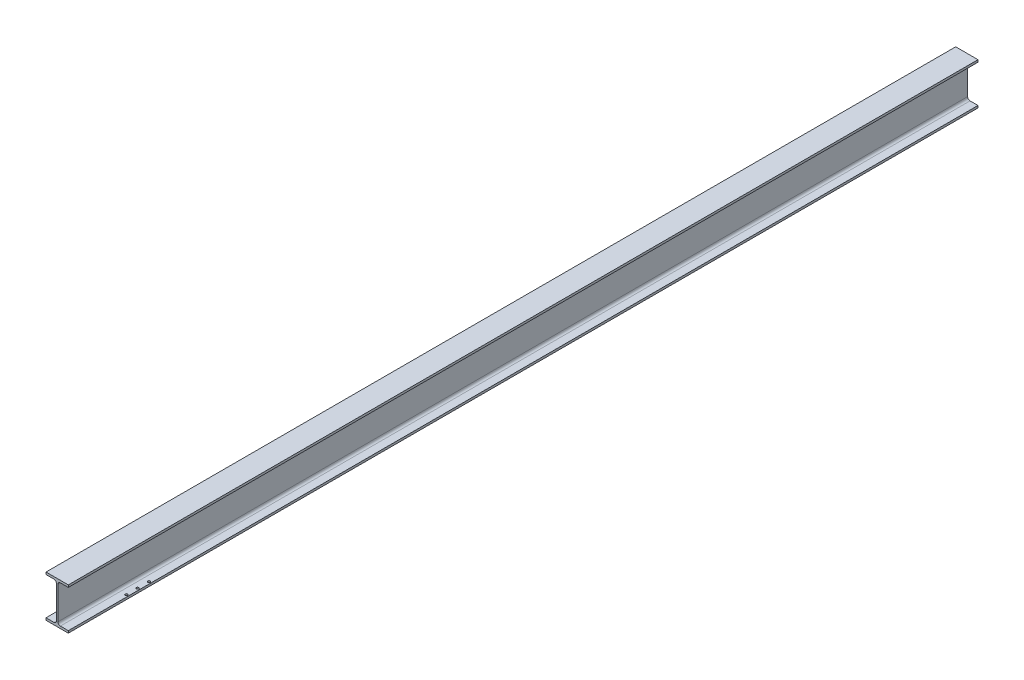
ISO-10303-21;
HEADER;
FILE_DESCRIPTION(('STEP AP214'),'2;1');
FILE_NAME('part.step','',(''),(''),'','','');
FILE_SCHEMA(('AUTOMOTIVE_DESIGN { 1 0 10303 214 1 1 1 1 }'));
ENDSEC;
DATA;
#1=APPLICATION_CONTEXT('core data for automotive mechanical design processes');
#2=APPLICATION_PROTOCOL_DEFINITION('international standard','automotive_design',2000,#1);
#3=PRODUCT_CONTEXT('',#1,'mechanical');
#4=PRODUCT('Part','Part','',(#3));
#5=PRODUCT_RELATED_PRODUCT_CATEGORY('part','',(#4));
#6=PRODUCT_DEFINITION_FORMATION('','',#4);
#7=PRODUCT_DEFINITION_CONTEXT('part definition',#1,'design');
#8=PRODUCT_DEFINITION('design','',#6,#7);
#9=PRODUCT_DEFINITION_SHAPE('','',#8);
#10=(LENGTH_UNIT() NAMED_UNIT(*) SI_UNIT(.MILLI.,.METRE.));
#11=(NAMED_UNIT(*) PLANE_ANGLE_UNIT() SI_UNIT($,.RADIAN.));
#12=(NAMED_UNIT(*) SI_UNIT($,.STERADIAN.) SOLID_ANGLE_UNIT());
#13=UNCERTAINTY_MEASURE_WITH_UNIT(LENGTH_MEASURE(1.E-05),#10,'distance_accuracy_value','');
#14=(GEOMETRIC_REPRESENTATION_CONTEXT(3) GLOBAL_UNCERTAINTY_ASSIGNED_CONTEXT((#13)) GLOBAL_UNIT_ASSIGNED_CONTEXT((#10,
#11,#12)) REPRESENTATION_CONTEXT('',''));
#15=CARTESIAN_POINT('',(0.,0.,0.));
#16=DIRECTION('',(0.,0.,1.));
#17=DIRECTION('',(1.,0.,0.));
#18=AXIS2_PLACEMENT_3D('',#15,#16,#17);
#19=CARTESIAN_POINT('',(0.,-60.,1305.));
#20=DIRECTION('',(0.,1.,0.));
#21=DIRECTION('',(-1.,0.,0.));
#22=AXIS2_PLACEMENT_3D('',#19,#20,#21);
#23=PLANE('',#22);
#24=CARTESIAN_POINT('',(26.,-60.,1067.5));
#25=DIRECTION('',(0.,-1.,0.));
#26=DIRECTION('',(0.,0.,-1.));
#27=AXIS2_PLACEMENT_3D('',#24,#25,#26);
#28=CIRCLE('',#27,3.49999999999999);
#29=CARTESIAN_POINT('',(26.,-60.,1064.));
#30=VERTEX_POINT('',#29);
#31=EDGE_CURVE('E564',#30,#30,#28,.T.);
#32=ORIENTED_EDGE('',*,*,#31,.F.);
#33=EDGE_LOOP('',(#32));
#34=FACE_BOUND('',#33,.T.);
#35=CARTESIAN_POINT('',(-26.,-60.,1100.));
#36=DIRECTION('',(0.,-1.,0.));
#37=DIRECTION('',(0.,0.,-1.));
#38=AXIS2_PLACEMENT_3D('',#35,#36,#37);
#39=CIRCLE('',#38,3.49999999999999);
#40=CARTESIAN_POINT('',(-26.,-60.,1096.5));
#41=VERTEX_POINT('',#40);
#42=EDGE_CURVE('E572',#41,#41,#39,.T.);
#43=ORIENTED_EDGE('',*,*,#42,.F.);
#44=EDGE_LOOP('',(#43));
#45=FACE_BOUND('',#44,.T.);
#46=CARTESIAN_POINT('',(26.,-60.,1100.));
#47=DIRECTION('',(0.,-1.,0.));
#48=DIRECTION('',(0.,0.,-1.));
#49=AXIS2_PLACEMENT_3D('',#46,#47,#48);
#50=CIRCLE('',#49,3.49999999999999);
#51=CARTESIAN_POINT('',(26.,-60.,1096.5));
#52=VERTEX_POINT('',#51);
#53=EDGE_CURVE('E578',#52,#52,#50,.T.);
#54=ORIENTED_EDGE('',*,*,#53,.F.);
#55=EDGE_LOOP('',(#54));
#56=FACE_BOUND('',#55,.T.);
#57=CARTESIAN_POINT('',(26.,-60.,1132.5));
#58=DIRECTION('',(0.,-1.,0.));
#59=DIRECTION('',(0.,0.,-1.));
#60=AXIS2_PLACEMENT_3D('',#57,#58,#59);
#61=CIRCLE('',#60,3.49999999999999);
#62=CARTESIAN_POINT('',(26.,-60.,1129.));
#63=VERTEX_POINT('',#62);
#64=EDGE_CURVE('E589',#63,#63,#61,.T.);
#65=ORIENTED_EDGE('',*,*,#64,.F.);
#66=EDGE_LOOP('',(#65));
#67=FACE_BOUND('',#66,.T.);
#68=DIRECTION('',(1.,0.,0.));
#69=VECTOR('',#68,1.);
#70=CARTESIAN_POINT('',(0.,-60.,-1305.));
#71=LINE('',#70,#69);
#72=CARTESIAN_POINT('',(-32.,-60.,-1305.));
#73=VERTEX_POINT('',#72);
#74=CARTESIAN_POINT('',(32.,-60.,-1305.));
#75=VERTEX_POINT('',#74);
#76=EDGE_CURVE('E166',#73,#75,#71,.T.);
#77=ORIENTED_EDGE('',*,*,#76,.T.);
#78=DIRECTION('',(0.,0.,-1.));
#79=VECTOR('',#78,1.);
#80=CARTESIAN_POINT('',(32.,-60.,1305.));
#81=LINE('',#80,#79);
#82=CARTESIAN_POINT('',(32.,-60.,1305.));
#83=VERTEX_POINT('',#82);
#84=EDGE_CURVE('E163',#83,#75,#81,.T.);
#85=ORIENTED_EDGE('',*,*,#84,.F.);
#86=DIRECTION('',(1.,0.,0.));
#87=VECTOR('',#86,1.);
#88=CARTESIAN_POINT('',(0.,-60.,1305.));
#89=LINE('',#88,#87);
#90=CARTESIAN_POINT('',(-32.,-60.,1305.));
#91=VERTEX_POINT('',#90);
#92=EDGE_CURVE('E148',#91,#83,#89,.T.);
#93=ORIENTED_EDGE('',*,*,#92,.F.);
#94=DIRECTION('',(0.,0.,-1.));
#95=VECTOR('',#94,1.);
#96=CARTESIAN_POINT('',(-32.,-60.,1305.));
#97=LINE('',#96,#95);
#98=EDGE_CURVE('E160',#91,#73,#97,.T.);
#99=ORIENTED_EDGE('',*,*,#98,.T.);
#100=EDGE_LOOP('',(#77,#85,#93,#99));
#101=FACE_BOUND('',#100,.T.);
#102=CARTESIAN_POINT('',(-26.,-60.,1132.5));
#103=DIRECTION('',(0.,-1.,0.));
#104=DIRECTION('',(0.,0.,-1.));
#105=AXIS2_PLACEMENT_3D('',#102,#103,#104);
#106=CIRCLE('',#105,3.49999999999999);
#107=CARTESIAN_POINT('',(-26.,-60.,1129.));
#108=VERTEX_POINT('',#107);
#109=EDGE_CURVE('E584',#108,#108,#106,.T.);
#110=ORIENTED_EDGE('',*,*,#109,.F.);
#111=EDGE_LOOP('',(#110));
#112=FACE_BOUND('',#111,.T.);
#113=CARTESIAN_POINT('',(-26.,-60.,1067.5));
#114=DIRECTION('',(0.,-1.,0.));
#115=DIRECTION('',(0.,0.,-1.));
#116=AXIS2_PLACEMENT_3D('',#113,#114,#115);
#117=CIRCLE('',#116,3.49999999999999);
#118=CARTESIAN_POINT('',(-26.,-60.,1064.));
#119=VERTEX_POINT('',#118);
#120=EDGE_CURVE('E561',#119,#119,#117,.T.);
#121=ORIENTED_EDGE('',*,*,#120,.F.);
#122=EDGE_LOOP('',(#121));
#123=FACE_BOUND('',#122,.T.);
#124=ADVANCED_FACE('F37',(#34,#45,#56,#67,#101,#112,#123),#23,.F.);
#125=CARTESIAN_POINT('',(-32.,60.,1305.));
#126=DIRECTION('',(0.,-1.,0.));
#127=DIRECTION('',(1.,0.,0.));
#128=AXIS2_PLACEMENT_3D('',#125,#126,#127);
#129=PLANE('',#128);
#130=DIRECTION('',(-1.,0.,0.));
#131=VECTOR('',#130,1.);
#132=CARTESIAN_POINT('',(-32.,60.,-1305.));
#133=LINE('',#132,#131);
#134=CARTESIAN_POINT('',(32.,60.,-1305.));
#135=VERTEX_POINT('',#134);
#136=CARTESIAN_POINT('',(-32.,60.,-1305.));
#137=VERTEX_POINT('',#136);
#138=EDGE_CURVE('E170',#135,#137,#133,.T.);
#139=ORIENTED_EDGE('',*,*,#138,.T.);
#140=DIRECTION('',(0.,0.,-1.));
#141=VECTOR('',#140,1.);
#142=CARTESIAN_POINT('',(-32.,60.,1305.));
#143=LINE('',#142,#141);
#144=CARTESIAN_POINT('',(-32.,60.,1305.));
#145=VERTEX_POINT('',#144);
#146=EDGE_CURVE('E245',#145,#137,#143,.T.);
#147=ORIENTED_EDGE('',*,*,#146,.F.);
#148=DIRECTION('',(-1.,0.,0.));
#149=VECTOR('',#148,1.);
#150=CARTESIAN_POINT('',(-32.,60.,1305.));
#151=LINE('',#150,#149);
#152=CARTESIAN_POINT('',(32.,60.,1305.));
#153=VERTEX_POINT('',#152);
#154=EDGE_CURVE('E211',#153,#145,#151,.T.);
#155=ORIENTED_EDGE('',*,*,#154,.F.);
#156=DIRECTION('',(0.,0.,-1.));
#157=VECTOR('',#156,1.);
#158=CARTESIAN_POINT('',(32.,60.,1305.));
#159=LINE('',#158,#157);
#160=EDGE_CURVE('E196',#153,#135,#159,.T.);
#161=ORIENTED_EDGE('',*,*,#160,.T.);
#162=EDGE_LOOP('',(#139,#147,#155,#161));
#163=FACE_BOUND('',#162,.T.);
#164=ADVANCED_FACE('F319',(#163),#129,.F.);
#165=CARTESIAN_POINT('',(-32.,53.7,1305.));
#166=DIRECTION('',(1.,0.,0.));
#167=DIRECTION('',(0.,0.,-1.));
#168=AXIS2_PLACEMENT_3D('',#165,#166,#167);
#169=PLANE('',#168);
#170=DIRECTION('',(0.,-1.,0.));
#171=VECTOR('',#170,1.);
#172=CARTESIAN_POINT('',(-32.,53.7,-1305.));
#173=LINE('',#172,#171);
#174=CARTESIAN_POINT('',(-32.,53.7,-1305.));
#175=VERTEX_POINT('',#174);
#176=EDGE_CURVE('E225',#137,#175,#173,.T.);
#177=ORIENTED_EDGE('',*,*,#176,.T.);
#178=DIRECTION('',(0.,0.,-1.));
#179=VECTOR('',#178,1.);
#180=CARTESIAN_POINT('',(-32.,53.7,1305.));
#181=LINE('',#180,#179);
#182=CARTESIAN_POINT('',(-32.,53.7,1305.));
#183=VERTEX_POINT('',#182);
#184=EDGE_CURVE('E242',#183,#175,#181,.T.);
#185=ORIENTED_EDGE('',*,*,#184,.F.);
#186=DIRECTION('',(0.,-1.,0.));
#187=VECTOR('',#186,1.);
#188=CARTESIAN_POINT('',(-32.,53.7,1305.));
#189=LINE('',#188,#187);
#190=EDGE_CURVE('E213',#145,#183,#189,.T.);
#191=ORIENTED_EDGE('',*,*,#190,.F.);
#192=ORIENTED_EDGE('',*,*,#146,.T.);
#193=EDGE_LOOP('',(#177,#185,#191,#192));
#194=FACE_BOUND('',#193,.T.);
#195=ADVANCED_FACE('F325',(#194),#169,.F.);
#196=CARTESIAN_POINT('',(-2.19999999999999,53.7,1305.));
#197=DIRECTION('',(0.,1.,0.));
#198=DIRECTION('',(0.,0.,1.));
#199=AXIS2_PLACEMENT_3D('',#196,#197,#198);
#200=PLANE('',#199);
#201=DIRECTION('',(1.,0.,0.));
#202=VECTOR('',#201,1.);
#203=CARTESIAN_POINT('',(-2.19999999999999,53.7,-1305.));
#204=LINE('',#203,#202);
#205=CARTESIAN_POINT('',(-9.19999999999999,53.7,-1305.));
#206=VERTEX_POINT('',#205);
#207=EDGE_CURVE('E227',#175,#206,#204,.T.);
#208=ORIENTED_EDGE('',*,*,#207,.T.);
#209=DIRECTION('',(0.,0.,-1.));
#210=VECTOR('',#209,1.);
#211=CARTESIAN_POINT('',(-9.19999999999999,53.7,1305.));
#212=LINE('',#211,#210);
#213=CARTESIAN_POINT('',(-9.19999999999999,53.7,1305.));
#214=VERTEX_POINT('',#213);
#215=EDGE_CURVE('E263',#206,#214,#212,.F.);
#216=ORIENTED_EDGE('',*,*,#215,.T.);
#217=DIRECTION('',(1.,0.,0.));
#218=VECTOR('',#217,1.);
#219=CARTESIAN_POINT('',(-2.19999999999999,53.7,1305.));
#220=LINE('',#219,#218);
#221=EDGE_CURVE('E215',#183,#214,#220,.T.);
#222=ORIENTED_EDGE('',*,*,#221,.F.);
#223=ORIENTED_EDGE('',*,*,#184,.T.);
#224=EDGE_LOOP('',(#208,#216,#222,#223));
#225=FACE_BOUND('',#224,.T.);
#226=ADVANCED_FACE('F328',(#225),#200,.F.);
#227=CARTESIAN_POINT('',(-2.19999999999999,-53.7,1305.));
#228=DIRECTION('',(1.,0.,0.));
#229=DIRECTION('',(0.,1.,0.));
#230=AXIS2_PLACEMENT_3D('',#227,#228,#229);
#231=PLANE('',#230);
#232=DIRECTION('',(0.,-1.,0.));
#233=VECTOR('',#232,1.);
#234=CARTESIAN_POINT('',(-2.19999999999999,-53.7,1305.));
#235=LINE('',#234,#233);
#236=CARTESIAN_POINT('',(-2.19999999999999,46.7,1305.));
#237=VERTEX_POINT('',#236);
#238=CARTESIAN_POINT('',(-2.19999999999999,-46.7,1305.));
#239=VERTEX_POINT('',#238);
#240=EDGE_CURVE('E218',#237,#239,#235,.T.);
#241=ORIENTED_EDGE('',*,*,#240,.F.);
#242=DIRECTION('',(0.,0.,-1.));
#243=VECTOR('',#242,1.);
#244=CARTESIAN_POINT('',(-2.19999999999999,46.7,-1305.));
#245=LINE('',#244,#243);
#246=CARTESIAN_POINT('',(-2.19999999999999,46.7,-1305.));
#247=VERTEX_POINT('',#246);
#248=EDGE_CURVE('E260',#237,#247,#245,.T.);
#249=ORIENTED_EDGE('',*,*,#248,.T.);
#250=DIRECTION('',(0.,-1.,0.));
#251=VECTOR('',#250,1.);
#252=CARTESIAN_POINT('',(-2.19999999999999,-53.7,-1305.));
#253=LINE('',#252,#251);
#254=CARTESIAN_POINT('',(-2.19999999999999,-46.7,-1305.));
#255=VERTEX_POINT('',#254);
#256=EDGE_CURVE('E230',#247,#255,#253,.T.);
#257=ORIENTED_EDGE('',*,*,#256,.T.);
#258=DIRECTION('',(0.,0.,-1.));
#259=VECTOR('',#258,1.);
#260=CARTESIAN_POINT('',(-2.19999999999999,-46.7,1305.));
#261=LINE('',#260,#259);
#262=EDGE_CURVE('E258',#255,#239,#261,.F.);
#263=ORIENTED_EDGE('',*,*,#262,.T.);
#264=EDGE_LOOP('',(#241,#249,#257,#263));
#265=FACE_BOUND('',#264,.T.);
#266=ADVANCED_FACE('F285',(#265),#231,.F.);
#267=CARTESIAN_POINT('',(-32.,-53.7,1305.));
#268=DIRECTION('',(0.,-1.,0.));
#269=DIRECTION('',(0.,0.,-1.));
#270=AXIS2_PLACEMENT_3D('',#267,#268,#269);
#271=PLANE('',#270);
#272=CARTESIAN_POINT('',(-26.,-53.7,1067.5));
#273=DIRECTION('',(0.,-1.,0.));
#274=DIRECTION('',(0.,0.,-1.));
#275=AXIS2_PLACEMENT_3D('',#272,#273,#274);
#276=CIRCLE('',#275,3.49999999999999);
#277=CARTESIAN_POINT('',(-26.,-53.7,1064.));
#278=VERTEX_POINT('',#277);
#279=EDGE_CURVE('E558',#278,#278,#276,.T.);
#280=ORIENTED_EDGE('',*,*,#279,.T.);
#281=EDGE_LOOP('',(#280));
#282=FACE_BOUND('',#281,.T.);
#283=CARTESIAN_POINT('',(-26.,-53.7,1100.));
#284=DIRECTION('',(0.,-1.,0.));
#285=DIRECTION('',(0.,0.,-1.));
#286=AXIS2_PLACEMENT_3D('',#283,#284,#285);
#287=CIRCLE('',#286,3.49999999999999);
#288=CARTESIAN_POINT('',(-26.,-53.7,1096.5));
#289=VERTEX_POINT('',#288);
#290=EDGE_CURVE('E575',#289,#289,#287,.T.);
#291=ORIENTED_EDGE('',*,*,#290,.T.);
#292=EDGE_LOOP('',(#291));
#293=FACE_BOUND('',#292,.T.);
#294=CARTESIAN_POINT('',(-26.,-53.7,1132.5));
#295=DIRECTION('',(0.,-1.,0.));
#296=DIRECTION('',(0.,0.,-1.));
#297=AXIS2_PLACEMENT_3D('',#294,#295,#296);
#298=CIRCLE('',#297,3.49999999999999);
#299=CARTESIAN_POINT('',(-26.,-53.7,1129.));
#300=VERTEX_POINT('',#299);
#301=EDGE_CURVE('E587',#300,#300,#298,.T.);
#302=ORIENTED_EDGE('',*,*,#301,.T.);
#303=EDGE_LOOP('',(#302));
#304=FACE_BOUND('',#303,.T.);
#305=DIRECTION('',(-1.,0.,0.));
#306=VECTOR('',#305,1.);
#307=CARTESIAN_POINT('',(-32.,-53.7,1305.));
#308=LINE('',#307,#306);
#309=CARTESIAN_POINT('',(-9.19999999999999,-53.7,1305.));
#310=VERTEX_POINT('',#309);
#311=CARTESIAN_POINT('',(-32.,-53.7,1305.));
#312=VERTEX_POINT('',#311);
#313=EDGE_CURVE('E220',#310,#312,#308,.T.);
#314=ORIENTED_EDGE('',*,*,#313,.F.);
#315=DIRECTION('',(0.,0.,-1.));
#316=VECTOR('',#315,1.);
#317=CARTESIAN_POINT('',(-9.19999999999999,-53.7,-1305.));
#318=LINE('',#317,#316);
#319=CARTESIAN_POINT('',(-9.19999999999999,-53.7,-1305.));
#320=VERTEX_POINT('',#319);
#321=EDGE_CURVE('E265',#310,#320,#318,.T.);
#322=ORIENTED_EDGE('',*,*,#321,.T.);
#323=DIRECTION('',(-1.,0.,0.));
#324=VECTOR('',#323,1.);
#325=CARTESIAN_POINT('',(-32.,-53.7,-1305.));
#326=LINE('',#325,#324);
#327=CARTESIAN_POINT('',(-32.,-53.7,-1305.));
#328=VERTEX_POINT('',#327);
#329=EDGE_CURVE('E233',#320,#328,#326,.T.);
#330=ORIENTED_EDGE('',*,*,#329,.T.);
#331=DIRECTION('',(0.,0.,-1.));
#332=VECTOR('',#331,1.);
#333=CARTESIAN_POINT('',(-32.,-53.7,1305.));
#334=LINE('',#333,#332);
#335=EDGE_CURVE('E239',#312,#328,#334,.T.);
#336=ORIENTED_EDGE('',*,*,#335,.F.);
#337=EDGE_LOOP('',(#314,#322,#330,#336));
#338=FACE_BOUND('',#337,.T.);
#339=ADVANCED_FACE('F288',(#282,#293,#304,#338),#271,.F.);
#340=CARTESIAN_POINT('',(-32.,-60.,1305.));
#341=DIRECTION('',(1.,0.,0.));
#342=DIRECTION('',(0.,0.,-1.));
#343=AXIS2_PLACEMENT_3D('',#340,#341,#342);
#344=PLANE('',#343);
#345=DIRECTION('',(0.,-1.,0.));
#346=VECTOR('',#345,1.);
#347=CARTESIAN_POINT('',(-32.,-60.,-1305.));
#348=LINE('',#347,#346);
#349=EDGE_CURVE('E235',#328,#73,#348,.T.);
#350=ORIENTED_EDGE('',*,*,#349,.T.);
#351=ORIENTED_EDGE('',*,*,#98,.F.);
#352=DIRECTION('',(0.,-1.,0.));
#353=VECTOR('',#352,1.);
#354=CARTESIAN_POINT('',(-32.,-60.,1305.));
#355=LINE('',#354,#353);
#356=EDGE_CURVE('E156',#312,#91,#355,.T.);
#357=ORIENTED_EDGE('',*,*,#356,.F.);
#358=ORIENTED_EDGE('',*,*,#335,.T.);
#359=EDGE_LOOP('',(#350,#351,#357,#358));
#360=FACE_BOUND('',#359,.T.);
#361=ADVANCED_FACE('F291',(#360),#344,.F.);
#362=CARTESIAN_POINT('',(0.,0.,1305.));
#363=DIRECTION('',(0.,0.,-1.));
#364=DIRECTION('',(-1.,0.,0.));
#365=AXIS2_PLACEMENT_3D('',#362,#363,#364);
#366=PLANE('',#365);
#367=ORIENTED_EDGE('',*,*,#154,.T.);
#368=ORIENTED_EDGE('',*,*,#190,.T.);
#369=ORIENTED_EDGE('',*,*,#221,.T.);
#370=CARTESIAN_POINT('',(-9.19999999999999,46.7,1305.));
#371=DIRECTION('',(0.,0.,-1.));
#372=DIRECTION('',(-1.,0.,0.));
#373=AXIS2_PLACEMENT_3D('',#370,#371,#372);
#374=CIRCLE('',#373,7.);
#375=EDGE_CURVE('E277',#214,#237,#374,.T.);
#376=ORIENTED_EDGE('',*,*,#375,.T.);
#377=ORIENTED_EDGE('',*,*,#240,.T.);
#378=CARTESIAN_POINT('',(-9.19999999999999,-46.7,1305.));
#379=DIRECTION('',(0.,0.,-1.));
#380=DIRECTION('',(-1.,0.,0.));
#381=AXIS2_PLACEMENT_3D('',#378,#379,#380);
#382=CIRCLE('',#381,7.);
#383=EDGE_CURVE('E11',#239,#310,#382,.T.);
#384=ORIENTED_EDGE('',*,*,#383,.T.);
#385=ORIENTED_EDGE('',*,*,#313,.T.);
#386=ORIENTED_EDGE('',*,*,#356,.T.);
#387=ORIENTED_EDGE('',*,*,#92,.T.);
#388=DIRECTION('',(0.,-1.,0.));
#389=VECTOR('',#388,1.);
#390=CARTESIAN_POINT('',(32.,-60.,1305.));
#391=LINE('',#390,#389);
#392=CARTESIAN_POINT('',(32.,-53.7,1305.));
#393=VERTEX_POINT('',#392);
#394=EDGE_CURVE('E154',#393,#83,#391,.T.);
#395=ORIENTED_EDGE('',*,*,#394,.F.);
#396=DIRECTION('',(1.,0.,0.));
#397=VECTOR('',#396,1.);
#398=CARTESIAN_POINT('',(32.,-53.7,1305.));
#399=LINE('',#398,#397);
#400=CARTESIAN_POINT('',(9.20000000000001,-53.7,1305.));
#401=VERTEX_POINT('',#400);
#402=EDGE_CURVE('E176',#401,#393,#399,.T.);
#403=ORIENTED_EDGE('',*,*,#402,.F.);
#404=CARTESIAN_POINT('',(9.2,-46.7,1305.));
#405=DIRECTION('',(0.,0.,-1.));
#406=DIRECTION('',(-1.,0.,0.));
#407=AXIS2_PLACEMENT_3D('',#404,#405,#406);
#408=CIRCLE('',#407,7.);
#409=CARTESIAN_POINT('',(2.2,-46.7,1305.));
#410=VERTEX_POINT('',#409);
#411=EDGE_CURVE('E269',#401,#410,#408,.T.);
#412=ORIENTED_EDGE('',*,*,#411,.T.);
#413=DIRECTION('',(0.,-1.,0.));
#414=VECTOR('',#413,1.);
#415=CARTESIAN_POINT('',(2.2,-53.7,1305.));
#416=LINE('',#415,#414);
#417=CARTESIAN_POINT('',(2.19999999999997,46.7,1305.));
#418=VERTEX_POINT('',#417);
#419=EDGE_CURVE('E179',#418,#410,#416,.T.);
#420=ORIENTED_EDGE('',*,*,#419,.F.);
#421=CARTESIAN_POINT('',(9.19999999999997,46.7,1305.));
#422=DIRECTION('',(0.,0.,-1.));
#423=DIRECTION('',(-1.,0.,0.));
#424=AXIS2_PLACEMENT_3D('',#421,#422,#423);
#425=CIRCLE('',#424,7.);
#426=CARTESIAN_POINT('',(9.19999999999997,53.7,1305.));
#427=VERTEX_POINT('',#426);
#428=EDGE_CURVE('E273',#418,#427,#425,.T.);
#429=ORIENTED_EDGE('',*,*,#428,.T.);
#430=DIRECTION('',(-1.,0.,0.));
#431=VECTOR('',#430,1.);
#432=CARTESIAN_POINT('',(2.19999999999997,53.7,1305.));
#433=LINE('',#432,#431);
#434=CARTESIAN_POINT('',(32.,53.7,1305.));
#435=VERTEX_POINT('',#434);
#436=EDGE_CURVE('E190',#435,#427,#433,.T.);
#437=ORIENTED_EDGE('',*,*,#436,.F.);
#438=DIRECTION('',(0.,-1.,0.));
#439=VECTOR('',#438,1.);
#440=CARTESIAN_POINT('',(32.,53.7,1305.));
#441=LINE('',#440,#439);
#442=EDGE_CURVE('E193',#153,#435,#441,.T.);
#443=ORIENTED_EDGE('',*,*,#442,.F.);
#444=EDGE_LOOP('',(#367,#368,#369,#376,#377,#384,#385,#386,#387,#395,#403,#412,#420,#429,#437,#443));
#445=FACE_BOUND('',#444,.T.);
#446=ADVANCED_FACE('F151',(#445),#366,.F.);
#447=CARTESIAN_POINT('',(0.,0.,-1305.));
#448=DIRECTION('',(0.,0.,-1.));
#449=DIRECTION('',(-1.,0.,0.));
#450=AXIS2_PLACEMENT_3D('',#447,#448,#449);
#451=PLANE('',#450);
#452=ORIENTED_EDGE('',*,*,#138,.F.);
#453=DIRECTION('',(0.,-1.,0.));
#454=VECTOR('',#453,1.);
#455=CARTESIAN_POINT('',(32.,53.7,-1305.));
#456=LINE('',#455,#454);
#457=CARTESIAN_POINT('',(32.,53.7,-1305.));
#458=VERTEX_POINT('',#457);
#459=EDGE_CURVE('E177',#135,#458,#456,.T.);
#460=ORIENTED_EDGE('',*,*,#459,.T.);
#461=DIRECTION('',(-1.,0.,0.));
#462=VECTOR('',#461,1.);
#463=CARTESIAN_POINT('',(2.19999999999997,53.7,-1305.));
#464=LINE('',#463,#462);
#465=CARTESIAN_POINT('',(9.19999999999997,53.7,-1305.));
#466=VERTEX_POINT('',#465);
#467=EDGE_CURVE('E182',#458,#466,#464,.T.);
#468=ORIENTED_EDGE('',*,*,#467,.T.);
#469=CARTESIAN_POINT('',(9.19999999999997,46.7,-1305.));
#470=DIRECTION('',(0.,0.,-1.));
#471=DIRECTION('',(-1.,0.,0.));
#472=AXIS2_PLACEMENT_3D('',#469,#470,#471);
#473=CIRCLE('',#472,7.);
#474=CARTESIAN_POINT('',(2.19999999999997,46.7,-1305.));
#475=VERTEX_POINT('',#474);
#476=EDGE_CURVE('E271',#466,#475,#473,.F.);
#477=ORIENTED_EDGE('',*,*,#476,.T.);
#478=DIRECTION('',(0.,-1.,0.));
#479=VECTOR('',#478,1.);
#480=CARTESIAN_POINT('',(2.2,-53.7,-1305.));
#481=LINE('',#480,#479);
#482=CARTESIAN_POINT('',(2.2,-46.7,-1305.));
#483=VERTEX_POINT('',#482);
#484=EDGE_CURVE('E201',#475,#483,#481,.T.);
#485=ORIENTED_EDGE('',*,*,#484,.T.);
#486=CARTESIAN_POINT('',(9.2,-46.7,-1305.));
#487=DIRECTION('',(0.,0.,-1.));
#488=DIRECTION('',(-1.,0.,0.));
#489=AXIS2_PLACEMENT_3D('',#486,#487,#488);
#490=CIRCLE('',#489,7.);
#491=CARTESIAN_POINT('',(9.20000000000001,-53.7,-1305.));
#492=VERTEX_POINT('',#491);
#493=EDGE_CURVE('E267',#483,#492,#490,.F.);
#494=ORIENTED_EDGE('',*,*,#493,.T.);
#495=DIRECTION('',(1.,0.,0.));
#496=VECTOR('',#495,1.);
#497=CARTESIAN_POINT('',(32.,-53.7,-1305.));
#498=LINE('',#497,#496);
#499=CARTESIAN_POINT('',(32.,-53.7,-1305.));
#500=VERTEX_POINT('',#499);
#501=EDGE_CURVE('E199',#492,#500,#498,.T.);
#502=ORIENTED_EDGE('',*,*,#501,.T.);
#503=DIRECTION('',(0.,-1.,0.));
#504=VECTOR('',#503,1.);
#505=CARTESIAN_POINT('',(32.,-60.,-1305.));
#506=LINE('',#505,#504);
#507=EDGE_CURVE('E197',#500,#75,#506,.T.);
#508=ORIENTED_EDGE('',*,*,#507,.T.);
#509=ORIENTED_EDGE('',*,*,#76,.F.);
#510=ORIENTED_EDGE('',*,*,#349,.F.);
#511=ORIENTED_EDGE('',*,*,#329,.F.);
#512=CARTESIAN_POINT('',(-9.19999999999999,-46.7,-1305.));
#513=DIRECTION('',(0.,0.,-1.));
#514=DIRECTION('',(-1.,0.,0.));
#515=AXIS2_PLACEMENT_3D('',#512,#513,#514);
#516=CIRCLE('',#515,7.);
#517=EDGE_CURVE('E45',#320,#255,#516,.F.);
#518=ORIENTED_EDGE('',*,*,#517,.T.);
#519=ORIENTED_EDGE('',*,*,#256,.F.);
#520=CARTESIAN_POINT('',(-9.19999999999999,46.7,-1305.));
#521=DIRECTION('',(0.,0.,-1.));
#522=DIRECTION('',(-1.,0.,0.));
#523=AXIS2_PLACEMENT_3D('',#520,#521,#522);
#524=CIRCLE('',#523,7.);
#525=EDGE_CURVE('E275',#247,#206,#524,.F.);
#526=ORIENTED_EDGE('',*,*,#525,.T.);
#527=ORIENTED_EDGE('',*,*,#207,.F.);
#528=ORIENTED_EDGE('',*,*,#176,.F.);
#529=EDGE_LOOP('',(#452,#460,#468,#477,#485,#494,#502,#508,#509,#510,#511,#518,#519,#526,#527,#528));
#530=FACE_BOUND('',#529,.T.);
#531=ADVANCED_FACE('F281',(#530),#451,.T.);
#532=CARTESIAN_POINT('',(32.,-60.,1305.));
#533=DIRECTION('',(1.,0.,0.));
#534=DIRECTION('',(0.,1.,0.));
#535=AXIS2_PLACEMENT_3D('',#532,#533,#534);
#536=PLANE('',#535);
#537=ORIENTED_EDGE('',*,*,#507,.F.);
#538=DIRECTION('',(0.,0.,-1.));
#539=VECTOR('',#538,1.);
#540=CARTESIAN_POINT('',(32.,-53.7,1305.));
#541=LINE('',#540,#539);
#542=EDGE_CURVE('E171',#393,#500,#541,.T.);
#543=ORIENTED_EDGE('',*,*,#542,.F.);
#544=ORIENTED_EDGE('',*,*,#394,.T.);
#545=ORIENTED_EDGE('',*,*,#84,.T.);
#546=EDGE_LOOP('',(#537,#543,#544,#545));
#547=FACE_BOUND('',#546,.T.);
#548=ADVANCED_FACE('F174',(#547),#536,.T.);
#549=CARTESIAN_POINT('',(32.,-53.7,1305.));
#550=DIRECTION('',(0.,1.,0.));
#551=DIRECTION('',(-1.,0.,0.));
#552=AXIS2_PLACEMENT_3D('',#549,#550,#551);
#553=PLANE('',#552);
#554=CARTESIAN_POINT('',(26.,-53.7,1067.5));
#555=DIRECTION('',(0.,1.,0.));
#556=DIRECTION('',(-1.,0.,0.));
#557=AXIS2_PLACEMENT_3D('',#554,#555,#556);
#558=CIRCLE('',#557,3.49999999999999);
#559=CARTESIAN_POINT('',(22.5,-53.7,1067.5));
#560=VERTEX_POINT('',#559);
#561=EDGE_CURVE('E569',#560,#560,#558,.T.);
#562=ORIENTED_EDGE('',*,*,#561,.F.);
#563=EDGE_LOOP('',(#562));
#564=FACE_BOUND('',#563,.T.);
#565=CARTESIAN_POINT('',(26.,-53.7,1100.));
#566=DIRECTION('',(0.,1.,0.));
#567=DIRECTION('',(-1.,0.,0.));
#568=AXIS2_PLACEMENT_3D('',#565,#566,#567);
#569=CIRCLE('',#568,3.49999999999999);
#570=CARTESIAN_POINT('',(22.5,-53.7,1100.));
#571=VERTEX_POINT('',#570);
#572=EDGE_CURVE('E581',#571,#571,#569,.T.);
#573=ORIENTED_EDGE('',*,*,#572,.F.);
#574=EDGE_LOOP('',(#573));
#575=FACE_BOUND('',#574,.T.);
#576=CARTESIAN_POINT('',(26.,-53.7,1132.5));
#577=DIRECTION('',(0.,1.,0.));
#578=DIRECTION('',(-1.,0.,0.));
#579=AXIS2_PLACEMENT_3D('',#576,#577,#578);
#580=CIRCLE('',#579,3.49999999999999);
#581=CARTESIAN_POINT('',(22.5,-53.7,1132.5));
#582=VERTEX_POINT('',#581);
#583=EDGE_CURVE('E185',#582,#582,#580,.T.);
#584=ORIENTED_EDGE('',*,*,#583,.F.);
#585=EDGE_LOOP('',(#584));
#586=FACE_BOUND('',#585,.T.);
#587=ORIENTED_EDGE('',*,*,#501,.F.);
#588=DIRECTION('',(0.,0.,-1.));
#589=VECTOR('',#588,1.);
#590=CARTESIAN_POINT('',(9.2,-53.7,1305.));
#591=LINE('',#590,#589);
#592=EDGE_CURVE('E253',#492,#401,#591,.F.);
#593=ORIENTED_EDGE('',*,*,#592,.T.);
#594=ORIENTED_EDGE('',*,*,#402,.T.);
#595=ORIENTED_EDGE('',*,*,#542,.T.);
#596=EDGE_LOOP('',(#587,#593,#594,#595));
#597=FACE_BOUND('',#596,.T.);
#598=ADVANCED_FACE('F295',(#564,#575,#586,#597),#553,.T.);
#599=CARTESIAN_POINT('',(2.2,-53.7,1305.));
#600=DIRECTION('',(1.,0.,0.));
#601=DIRECTION('',(0.,1.,0.));
#602=AXIS2_PLACEMENT_3D('',#599,#600,#601);
#603=PLANE('',#602);
#604=ORIENTED_EDGE('',*,*,#419,.T.);
#605=DIRECTION('',(0.,0.,-1.));
#606=VECTOR('',#605,1.);
#607=CARTESIAN_POINT('',(2.2,-46.7,-1305.));
#608=LINE('',#607,#606);
#609=EDGE_CURVE('E250',#410,#483,#608,.T.);
#610=ORIENTED_EDGE('',*,*,#609,.T.);
#611=ORIENTED_EDGE('',*,*,#484,.F.);
#612=DIRECTION('',(0.,0.,-1.));
#613=VECTOR('',#612,1.);
#614=CARTESIAN_POINT('',(2.19999999999997,46.7,1305.));
#615=LINE('',#614,#613);
#616=EDGE_CURVE('E248',#475,#418,#615,.F.);
#617=ORIENTED_EDGE('',*,*,#616,.T.);
#618=EDGE_LOOP('',(#604,#610,#611,#617));
#619=FACE_BOUND('',#618,.T.);
#620=ADVANCED_FACE('F303',(#619),#603,.T.);
#621=CARTESIAN_POINT('',(2.19999999999997,53.7,1305.));
#622=DIRECTION('',(0.,-1.,0.));
#623=DIRECTION('',(1.,0.,0.));
#624=AXIS2_PLACEMENT_3D('',#621,#622,#623);
#625=PLANE('',#624);
#626=ORIENTED_EDGE('',*,*,#436,.T.);
#627=DIRECTION('',(0.,0.,-1.));
#628=VECTOR('',#627,1.);
#629=CARTESIAN_POINT('',(9.19999999999997,53.7,-1305.));
#630=LINE('',#629,#628);
#631=EDGE_CURVE('E255',#427,#466,#630,.T.);
#632=ORIENTED_EDGE('',*,*,#631,.T.);
#633=ORIENTED_EDGE('',*,*,#467,.F.);
#634=DIRECTION('',(0.,0.,-1.));
#635=VECTOR('',#634,1.);
#636=CARTESIAN_POINT('',(32.,53.7,1305.));
#637=LINE('',#636,#635);
#638=EDGE_CURVE('E208',#435,#458,#637,.T.);
#639=ORIENTED_EDGE('',*,*,#638,.F.);
#640=EDGE_LOOP('',(#626,#632,#633,#639));
#641=FACE_BOUND('',#640,.T.);
#642=ADVANCED_FACE('F311',(#641),#625,.T.);
#643=CARTESIAN_POINT('',(32.,53.7,1305.));
#644=DIRECTION('',(1.,0.,0.));
#645=DIRECTION('',(0.,1.,0.));
#646=AXIS2_PLACEMENT_3D('',#643,#644,#645);
#647=PLANE('',#646);
#648=ORIENTED_EDGE('',*,*,#459,.F.);
#649=ORIENTED_EDGE('',*,*,#160,.F.);
#650=ORIENTED_EDGE('',*,*,#442,.T.);
#651=ORIENTED_EDGE('',*,*,#638,.T.);
#652=EDGE_LOOP('',(#648,#649,#650,#651));
#653=FACE_BOUND('',#652,.T.);
#654=ADVANCED_FACE('F317',(#653),#647,.T.);
#655=CARTESIAN_POINT('',(9.2,-46.7,1305.));
#656=DIRECTION('',(0.,0.,1.));
#657=DIRECTION('',(1.,0.,0.));
#658=AXIS2_PLACEMENT_3D('',#655,#656,#657);
#659=CYLINDRICAL_SURFACE('',#658,7.);
#660=ORIENTED_EDGE('',*,*,#411,.F.);
#661=ORIENTED_EDGE('',*,*,#592,.F.);
#662=ORIENTED_EDGE('',*,*,#493,.F.);
#663=ORIENTED_EDGE('',*,*,#609,.F.);
#664=EDGE_LOOP('',(#660,#661,#662,#663));
#665=FACE_BOUND('',#664,.T.);
#666=ADVANCED_FACE('F300',(#665),#659,.F.);
#667=CARTESIAN_POINT('',(9.19999999999997,46.7,1305.));
#668=DIRECTION('',(0.,0.,1.));
#669=DIRECTION('',(1.,0.,0.));
#670=AXIS2_PLACEMENT_3D('',#667,#668,#669);
#671=CYLINDRICAL_SURFACE('',#670,7.);
#672=ORIENTED_EDGE('',*,*,#428,.F.);
#673=ORIENTED_EDGE('',*,*,#616,.F.);
#674=ORIENTED_EDGE('',*,*,#476,.F.);
#675=ORIENTED_EDGE('',*,*,#631,.F.);
#676=EDGE_LOOP('',(#672,#673,#674,#675));
#677=FACE_BOUND('',#676,.T.);
#678=ADVANCED_FACE('F309',(#677),#671,.F.);
#679=CARTESIAN_POINT('',(-9.19999999999999,46.7,1305.));
#680=DIRECTION('',(0.,0.,1.));
#681=DIRECTION('',(1.,0.,0.));
#682=AXIS2_PLACEMENT_3D('',#679,#680,#681);
#683=CYLINDRICAL_SURFACE('',#682,7.);
#684=ORIENTED_EDGE('',*,*,#375,.F.);
#685=ORIENTED_EDGE('',*,*,#215,.F.);
#686=ORIENTED_EDGE('',*,*,#525,.F.);
#687=ORIENTED_EDGE('',*,*,#248,.F.);
#688=EDGE_LOOP('',(#684,#685,#686,#687));
#689=FACE_BOUND('',#688,.T.);
#690=ADVANCED_FACE('F331',(#689),#683,.F.);
#691=CARTESIAN_POINT('',(-9.19999999999999,-46.7,1305.));
#692=DIRECTION('',(0.,0.,1.));
#693=DIRECTION('',(1.,0.,0.));
#694=AXIS2_PLACEMENT_3D('',#691,#692,#693);
#695=CYLINDRICAL_SURFACE('',#694,7.);
#696=ORIENTED_EDGE('',*,*,#383,.F.);
#697=ORIENTED_EDGE('',*,*,#262,.F.);
#698=ORIENTED_EDGE('',*,*,#517,.F.);
#699=ORIENTED_EDGE('',*,*,#321,.F.);
#700=EDGE_LOOP('',(#696,#697,#698,#699));
#701=FACE_BOUND('',#700,.T.);
#702=ADVANCED_FACE('F39',(#701),#695,.F.);
#703=CARTESIAN_POINT('',(26.,-60.,1132.5));
#704=DIRECTION('',(0.,-1.,0.));
#705=DIRECTION('',(0.,0.,-1.));
#706=AXIS2_PLACEMENT_3D('',#703,#704,#705);
#707=CYLINDRICAL_SURFACE('',#706,3.49999999999999);
#708=ORIENTED_EDGE('',*,*,#64,.T.);
#709=EDGE_LOOP('',(#708));
#710=FACE_BOUND('',#709,.T.);
#711=ORIENTED_EDGE('',*,*,#583,.T.);
#712=EDGE_LOOP('',(#711));
#713=FACE_BOUND('',#712,.T.);
#714=ADVANCED_FACE('F337',(#710,#713),#707,.F.);
#715=CARTESIAN_POINT('',(-26.,-60.,1132.5));
#716=DIRECTION('',(0.,-1.,0.));
#717=DIRECTION('',(0.,0.,-1.));
#718=AXIS2_PLACEMENT_3D('',#715,#716,#717);
#719=CYLINDRICAL_SURFACE('',#718,3.49999999999999);
#720=ORIENTED_EDGE('',*,*,#301,.F.);
#721=EDGE_LOOP('',(#720));
#722=FACE_BOUND('',#721,.T.);
#723=ORIENTED_EDGE('',*,*,#109,.T.);
#724=EDGE_LOOP('',(#723));
#725=FACE_BOUND('',#724,.T.);
#726=ADVANCED_FACE('F435',(#722,#725),#719,.F.);
#727=CARTESIAN_POINT('',(26.,-60.,1100.));
#728=DIRECTION('',(0.,-1.,0.));
#729=DIRECTION('',(0.,0.,-1.));
#730=AXIS2_PLACEMENT_3D('',#727,#728,#729);
#731=CYLINDRICAL_SURFACE('',#730,3.49999999999999);
#732=ORIENTED_EDGE('',*,*,#53,.T.);
#733=EDGE_LOOP('',(#732));
#734=FACE_BOUND('',#733,.T.);
#735=ORIENTED_EDGE('',*,*,#572,.T.);
#736=EDGE_LOOP('',(#735));
#737=FACE_BOUND('',#736,.T.);
#738=ADVANCED_FACE('F513',(#734,#737),#731,.F.);
#739=CARTESIAN_POINT('',(-26.,-60.,1100.));
#740=DIRECTION('',(0.,-1.,0.));
#741=DIRECTION('',(0.,0.,-1.));
#742=AXIS2_PLACEMENT_3D('',#739,#740,#741);
#743=CYLINDRICAL_SURFACE('',#742,3.49999999999999);
#744=ORIENTED_EDGE('',*,*,#290,.F.);
#745=EDGE_LOOP('',(#744));
#746=FACE_BOUND('',#745,.T.);
#747=ORIENTED_EDGE('',*,*,#42,.T.);
#748=EDGE_LOOP('',(#747));
#749=FACE_BOUND('',#748,.T.);
#750=ADVANCED_FACE('F521',(#746,#749),#743,.F.);
#751=CARTESIAN_POINT('',(26.,-60.,1067.5));
#752=DIRECTION('',(0.,-1.,0.));
#753=DIRECTION('',(0.,0.,-1.));
#754=AXIS2_PLACEMENT_3D('',#751,#752,#753);
#755=CYLINDRICAL_SURFACE('',#754,3.49999999999999);
#756=ORIENTED_EDGE('',*,*,#31,.T.);
#757=EDGE_LOOP('',(#756));
#758=FACE_BOUND('',#757,.T.);
#759=ORIENTED_EDGE('',*,*,#561,.T.);
#760=EDGE_LOOP('',(#759));
#761=FACE_BOUND('',#760,.T.);
#762=ADVANCED_FACE('F530',(#758,#761),#755,.F.);
#763=CARTESIAN_POINT('',(-26.,-60.,1067.5));
#764=DIRECTION('',(0.,-1.,0.));
#765=DIRECTION('',(0.,0.,-1.));
#766=AXIS2_PLACEMENT_3D('',#763,#764,#765);
#767=CYLINDRICAL_SURFACE('',#766,3.49999999999999);
#768=ORIENTED_EDGE('',*,*,#279,.F.);
#769=EDGE_LOOP('',(#768));
#770=FACE_BOUND('',#769,.T.);
#771=ORIENTED_EDGE('',*,*,#120,.T.);
#772=EDGE_LOOP('',(#771));
#773=FACE_BOUND('',#772,.T.);
#774=ADVANCED_FACE('F539',(#770,#773),#767,.F.);
#775=CLOSED_SHELL('',(#124,#164,#195,#226,#266,#339,#361,#446,#531,#548,#598,#620,#642,#654,
#666,#678,#690,#702,#714,#726,#738,#750,#762,#774));
#776=MANIFOLD_SOLID_BREP('B2',#775);
#777=ADVANCED_BREP_SHAPE_REPRESENTATION('',(#18,#776),#14);
#778=SHAPE_DEFINITION_REPRESENTATION(#9,#777);
ENDSEC;
END-ISO-10303-21;
